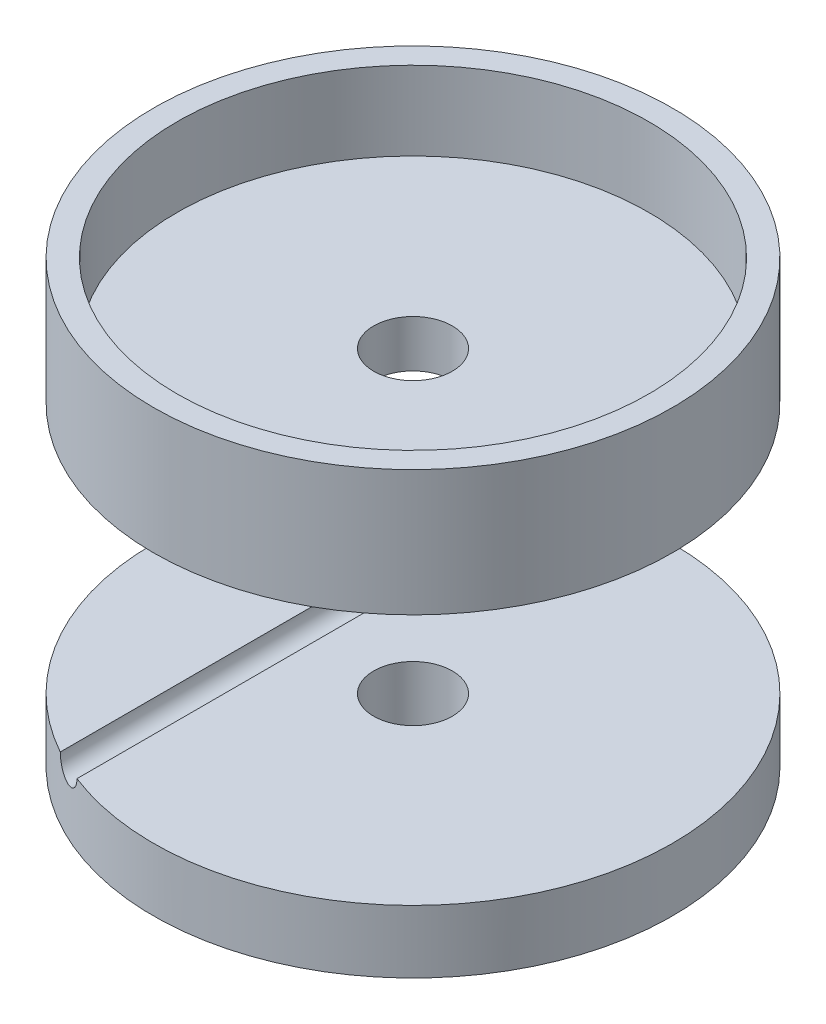
ISO-10303-21;
HEADER;
FILE_DESCRIPTION(('STEP AP214'),'2;1');
FILE_NAME('part.step','',(''),(''),'','','');
FILE_SCHEMA(('AUTOMOTIVE_DESIGN { 1 0 10303 214 1 1 1 1 }'));
ENDSEC;
DATA;
#1=APPLICATION_CONTEXT('core data for automotive mechanical design processes');
#2=APPLICATION_PROTOCOL_DEFINITION('international standard','automotive_design',2000,#1);
#3=PRODUCT_CONTEXT('',#1,'mechanical');
#4=PRODUCT('Part','Part','',(#3));
#5=PRODUCT_RELATED_PRODUCT_CATEGORY('part','',(#4));
#6=PRODUCT_DEFINITION_FORMATION('','',#4);
#7=PRODUCT_DEFINITION_CONTEXT('part definition',#1,'design');
#8=PRODUCT_DEFINITION('design','',#6,#7);
#9=PRODUCT_DEFINITION_SHAPE('','',#8);
#10=(LENGTH_UNIT() NAMED_UNIT(*) SI_UNIT(.MILLI.,.METRE.));
#11=(NAMED_UNIT(*) PLANE_ANGLE_UNIT() SI_UNIT($,.RADIAN.));
#12=(NAMED_UNIT(*) SI_UNIT($,.STERADIAN.) SOLID_ANGLE_UNIT());
#13=UNCERTAINTY_MEASURE_WITH_UNIT(LENGTH_MEASURE(1.E-05),#10,'distance_accuracy_value','');
#14=(GEOMETRIC_REPRESENTATION_CONTEXT(3) GLOBAL_UNCERTAINTY_ASSIGNED_CONTEXT((#13)) GLOBAL_UNIT_ASSIGNED_CONTEXT((#10,
#11,#12)) REPRESENTATION_CONTEXT('',''));
#15=CARTESIAN_POINT('',(0.,0.,0.));
#16=DIRECTION('',(0.,0.,1.));
#17=DIRECTION('',(1.,0.,0.));
#18=AXIS2_PLACEMENT_3D('',#15,#16,#17);
#19=CARTESIAN_POINT('',(0.,-16.,0.));
#20=DIRECTION('',(0.,-1.,0.));
#21=DIRECTION('',(0.,0.,-1.));
#22=AXIS2_PLACEMENT_3D('',#19,#20,#21);
#23=PLANE('',#22);
#24=CARTESIAN_POINT('',(0.,-16.,0.));
#25=DIRECTION('',(0.,-1.,0.));
#26=DIRECTION('',(0.,0.,-1.));
#27=AXIS2_PLACEMENT_3D('',#24,#25,#26);
#28=CIRCLE('',#27,2.5);
#29=CARTESIAN_POINT('',(0.,-16.,-2.5));
#30=VERTEX_POINT('',#29);
#31=EDGE_CURVE('E99',#30,#30,#28,.T.);
#32=ORIENTED_EDGE('',*,*,#31,.T.);
#33=EDGE_LOOP('',(#32));
#34=FACE_BOUND('',#33,.T.);
#35=CARTESIAN_POINT('',(0.,-16.,0.));
#36=DIRECTION('',(0.,-1.,0.));
#37=DIRECTION('',(0.,0.,-1.));
#38=AXIS2_PLACEMENT_3D('',#35,#36,#37);
#39=CIRCLE('',#38,16.5);
#40=CARTESIAN_POINT('',(-6.,-16.,-15.3704261489394));
#41=VERTEX_POINT('',#40);
#42=CARTESIAN_POINT('',(-6.,-16.,15.3704261489394));
#43=VERTEX_POINT('',#42);
#44=EDGE_CURVE('E85',#41,#43,#39,.T.);
#45=ORIENTED_EDGE('',*,*,#44,.F.);
#46=DIRECTION('',(0.,0.,1.));
#47=VECTOR('',#46,1.);
#48=CARTESIAN_POINT('',(-6.,-16.,-16.5));
#49=LINE('',#48,#47);
#50=EDGE_CURVE('E12',#41,#43,#49,.T.);
#51=ORIENTED_EDGE('',*,*,#50,.T.);
#52=EDGE_LOOP('',(#45,#51));
#53=FACE_BOUND('',#52,.T.);
#54=ADVANCED_FACE('F49',(#34,#53),#23,.F.);
#55=CARTESIAN_POINT('',(0.,-16.,0.));
#56=DIRECTION('',(0.,-1.,0.));
#57=DIRECTION('',(0.,0.,-1.));
#58=AXIS2_PLACEMENT_3D('',#55,#56,#57);
#59=CYLINDRICAL_SURFACE('',#58,16.5);
#60=CARTESIAN_POINT('',(-6.,-16.,-15.3704261489394));
#61=CARTESIAN_POINT('',(-5.99999926206739,-16.0266737083966,-15.3704260197381));
#62=CARTESIAN_POINT('',(-6.00106798362648,-16.0533341927296,-15.3700092951358));
#63=CARTESIAN_POINT('',(-6.005325375613,-16.1064549239374,-15.368346524673));
#64=CARTESIAN_POINT('',(-6.00851369494195,-16.132915203241,-15.3671006161616));
#65=CARTESIAN_POINT('',(-6.02120262514664,-16.2115778522633,-15.3621354754465));
#66=CARTESIAN_POINT('',(-6.03382749158354,-16.2632373335658,-15.3571887605155));
#67=CARTESIAN_POINT('',(-6.06691487067275,-16.3635165452906,-15.3441472736558));
#68=CARTESIAN_POINT('',(-6.08737669065643,-16.4121365439158,-15.3360527799424));
#69=CARTESIAN_POINT('',(-6.13537046750988,-16.5051269603056,-15.3169152979954));
#70=CARTESIAN_POINT('',(-6.16290407635965,-16.5494963817998,-15.3058716208044));
#71=CARTESIAN_POINT('',(-6.22484173018992,-16.633989199172,-15.2807881236854));
#72=CARTESIAN_POINT('',(-6.25940021266307,-16.6739788486964,-15.2666803536036));
#73=CARTESIAN_POINT('',(-6.33378246148393,-16.7475924695746,-15.2359711726941));
#74=CARTESIAN_POINT('',(-6.37360790433865,-16.7812144057223,-15.2193689676419));
#75=CARTESIAN_POINT('',(-6.46005581810927,-16.843491972609,-15.1828856125483));
#76=CARTESIAN_POINT('',(-6.5069516151049,-16.871683994198,-15.1628616262036));
#77=CARTESIAN_POINT('',(-6.60397112801003,-16.9198353701643,-15.1208585023697));
#78=CARTESIAN_POINT('',(-6.65409575029276,-16.939792401127,-15.0988788152237));
#79=CARTESIAN_POINT('',(-6.76032464369901,-16.9725659179548,-15.0516326945565));
#80=CARTESIAN_POINT('',(-6.81658792344105,-16.9846908194012,-15.026243837995));
#81=CARTESIAN_POINT('',(-6.92985232213036,-16.9991709331779,-14.9743458325243));
#82=CARTESIAN_POINT('',(-6.98685372197054,-17.0015223096189,-14.9478362478771));
#83=CARTESIAN_POINT('',(-7.10415388867534,-16.996409877711,-14.8924640659281));
#84=CARTESIAN_POINT('',(-7.16440649120026,-16.9882525555459,-14.8635659822647));
#85=CARTESIAN_POINT('',(-7.28258336450953,-16.9611576296323,-14.8060225573794));
#86=CARTESIAN_POINT('',(-7.34050691772942,-16.9422167303729,-14.77737729614));
#87=CARTESIAN_POINT('',(-7.45381590968531,-16.8932814172599,-14.7205550783329));
#88=CARTESIAN_POINT('',(-7.50910442802574,-16.863027621886,-14.6924067783987));
#89=CARTESIAN_POINT('',(-7.61378429042706,-16.7920013588214,-14.6384342734491));
#90=CARTESIAN_POINT('',(-7.66317656955203,-16.7512305622357,-14.6126097000822));
#91=CARTESIAN_POINT('',(-7.7517024208485,-16.6623213074922,-14.5658328969198));
#92=CARTESIAN_POINT('',(-7.791239471844,-16.6146844074105,-14.5446956077332));
#93=CARTESIAN_POINT('',(-7.86143218203278,-16.5116709619649,-14.5068769845929));
#94=CARTESIAN_POINT('',(-7.89209337893741,-16.4562992745057,-14.4901928727777));
#95=CARTESIAN_POINT('',(-7.93972803344417,-16.346499259181,-14.4641408478129));
#96=CARTESIAN_POINT('',(-7.95789276614095,-16.2927363642376,-14.4541403365092));
#97=CARTESIAN_POINT('',(-7.98487103302283,-16.1823098722885,-14.4392547980045));
#98=CARTESIAN_POINT('',(-7.99371219785292,-16.1256553708114,-14.4343546562844));
#99=CARTESIAN_POINT('',(-7.99842685565386,-16.0572442061748,-14.4317416434226));
#100=CARTESIAN_POINT('',(-7.9990169059998,-16.0457983113665,-14.4314146223447));
#101=CARTESIAN_POINT('',(-7.99980277384196,-16.0229031436854,-14.4309790561515));
#102=CARTESIAN_POINT('',(-7.99999908282626,-16.0114538928885,-14.4308702386634));
#103=CARTESIAN_POINT('',(-8.,-16.,-14.4308696896618));
#104=B_SPLINE_CURVE_WITH_KNOTS('',3,(#60,#61,#62,#63,#64,#65,#66,#67,#68,#69,#70,#71,#72,#73,
#74,#75,#76,#77,#78,#79,#80,#81,#82,#83,#84,#85,#86,#87,#88,#89,#90,#91,#92,#93,#94,#95,#96,#97,
#98,#99,#100,#101,#102,#103),.UNSPECIFIED.,.F.,.F.,(4,2,2,2,2,2,2,2,2,2,2,2,2,2,2,2,2,2,2,2,2,
4),(0.,0.0799704324047442,0.159927621493229,0.319322997888253,0.478704289382805,
0.638122846491345,0.801523533545703,0.964976357827887,1.13903166383457,1.31313604416571,
1.50104419203492,1.68902608267779,1.89007272838663,2.09118084788286,2.29721491841289,
2.50321627118658,2.69836046994231,2.89338265307252,3.06529986470395,3.23670615087795,
3.27109930550798,3.30544950206118),.UNSPECIFIED.);
#105=CARTESIAN_POINT('',(-8.,-16.,-14.4308696896618));
#106=VERTEX_POINT('',#105);
#107=EDGE_CURVE('E66',#41,#106,#104,.T.);
#108=ORIENTED_EDGE('',*,*,#107,.F.);
#109=ORIENTED_EDGE('',*,*,#44,.T.);
#110=CARTESIAN_POINT('',(-8.,-16.,14.4308696896618));
#111=CARTESIAN_POINT('',(-8.00000148594661,-16.0257084986515,14.4308684265361));
#112=CARTESIAN_POINT('',(-7.99900787471992,-16.0514035053491,14.4314197341218));
#113=CARTESIAN_POINT('',(-7.99505508353358,-16.1025864897797,14.4336101479054));
#114=CARTESIAN_POINT('',(-7.99209658037501,-16.1280745357408,14.4352488795432));
#115=CARTESIAN_POINT('',(-7.9803498342188,-16.2037259029646,14.4417485342758));
#116=CARTESIAN_POINT('',(-7.96868977119833,-16.2533430579839,14.448193311303));
#117=CARTESIAN_POINT('',(-7.93827209922905,-16.3495635819688,14.4649276558678));
#118=CARTESIAN_POINT('',(-7.91952100316631,-16.3961696706496,14.4752136952212));
#119=CARTESIAN_POINT('',(-7.87569634213005,-16.4854167893375,14.4991044002607));
#120=CARTESIAN_POINT('',(-7.8506174323495,-16.5280544254934,14.5127118710854));
#121=CARTESIAN_POINT('',(-7.7935450363012,-16.6106890272663,14.5434438128985));
#122=CARTESIAN_POINT('',(-7.7612544154346,-16.6504243972718,14.5607170018314));
#123=CARTESIAN_POINT('',(-7.69167416168751,-16.7239840397362,14.5975922494462));
#124=CARTESIAN_POINT('',(-7.65438271543555,-16.7578061576672,14.6171951526214));
#125=CARTESIAN_POINT('',(-7.57109860479741,-16.8227729157471,14.6605223972741));
#126=CARTESIAN_POINT('',(-7.52459850260761,-16.8531252788626,14.6844598575135));
#127=CARTESIAN_POINT('',(-7.42779302201368,-16.9055533121559,14.7336635989156));
#128=CARTESIAN_POINT('',(-7.37748595147523,-16.9276252755572,14.7589304694407));
#129=CARTESIAN_POINT('',(-7.26911062875992,-16.9649765684006,14.8126308646609));
#130=CARTESIAN_POINT('',(-7.21076707604793,-16.9793671157607,14.8411302501516));
#131=CARTESIAN_POINT('',(-7.09240088451056,-16.9975216491735,14.8980591519522));
#132=CARTESIAN_POINT('',(-7.03237769179556,-17.0012820870509,14.9264886417692));
#133=CARTESIAN_POINT('',(-6.90996876269408,-16.9978879905538,14.9835595215204));
#134=CARTESIAN_POINT('',(-6.84757867157137,-16.9903197324247,15.0121690287743));
#135=CARTESIAN_POINT('',(-6.72458506424107,-16.9633834516966,15.067664274096));
#136=CARTESIAN_POINT('',(-6.6639813504263,-16.9440167394046,15.0945502032137));
#137=CARTESIAN_POINT('',(-6.54868311887153,-16.8944901600903,15.1449190742863));
#138=CARTESIAN_POINT('',(-6.49385687423008,-16.8647256604488,15.1684874122354));
#139=CARTESIAN_POINT('',(-6.38989818001122,-16.7947915065548,15.212573393897));
#140=CARTESIAN_POINT('',(-6.34076262882496,-16.754627559326,15.2330927011707));
#141=CARTESIAN_POINT('',(-6.25388875963906,-16.6684044602335,15.2689526371094));
#142=CARTESIAN_POINT('',(-6.21555714712688,-16.6230602405857,15.2845740902699));
#143=CARTESIAN_POINT('',(-6.14714520720001,-16.5255286424195,15.3122164358258));
#144=CARTESIAN_POINT('',(-6.11706307756574,-16.4733427622494,15.324238114697));
#145=CARTESIAN_POINT('',(-6.06859517402999,-16.368195370453,15.3434930887042));
#146=CARTESIAN_POINT('',(-6.04946523481276,-16.3156312033791,15.3510329247328));
#147=CARTESIAN_POINT('',(-6.02022586042272,-16.2077306031792,15.3625236410116));
#148=CARTESIAN_POINT('',(-6.01009809102934,-16.1524000482362,15.36648181613));
#149=CARTESIAN_POINT('',(-6.00311902051767,-16.0805673015387,15.3692082537474));
#150=CARTESIAN_POINT('',(-6.00194901449669,-16.064466315304,15.3696651887444));
#151=CARTESIAN_POINT('',(-6.00039066694123,-16.0322459164747,15.3702736884506));
#152=CARTESIAN_POINT('',(-6.00000111110759,-16.0161265716102,15.3704257275465));
#153=CARTESIAN_POINT('',(-6.,-16.,15.3704261489394));
#154=B_SPLINE_CURVE_WITH_KNOTS('',3,(#110,#111,#112,#113,#114,#115,#116,#117,#118,#119,#120,
#121,#122,#123,#124,#125,#126,#127,#128,#129,#130,#131,#132,#133,#134,#135,#136,#137,#138,#139,
#140,#141,#142,#143,#144,#145,#146,#147,#148,#149,#150,#151,#152,#153),.UNSPECIFIED.,.F.,.F.,(4,
2,2,2,2,2,2,2,2,2,2,2,2,2,2,2,2,2,2,2,2,4),(0.,0.0770741834044095,0.154121832598794,
0.307428292566416,0.460594286118729,0.61389008742965,0.775350559782561,0.936869739152714,
1.11752980647166,1.29827065125702,1.49690458072853,1.69560480348197,1.90174074201079,
2.10785379176823,2.30685675164318,2.50575073300496,2.68895569353402,2.87212059833097,
3.04060615007704,3.20874776513858,3.25718303936743,3.30554289464911),.UNSPECIFIED.);
#155=CARTESIAN_POINT('',(-8.,-16.,14.4308696896618));
#156=VERTEX_POINT('',#155);
#157=EDGE_CURVE('E75',#156,#43,#154,.T.);
#158=ORIENTED_EDGE('',*,*,#157,.F.);
#159=EDGE_CURVE('E80',#156,#106,#39,.T.);
#160=ORIENTED_EDGE('',*,*,#159,.T.);
#161=EDGE_LOOP('',(#108,#109,#158,#160));
#162=FACE_BOUND('',#161,.T.);
#163=CARTESIAN_POINT('',(0.,-20.,0.));
#164=DIRECTION('',(0.,-1.,0.));
#165=DIRECTION('',(0.,0.,-1.));
#166=AXIS2_PLACEMENT_3D('',#163,#164,#165);
#167=CIRCLE('',#166,16.5);
#168=CARTESIAN_POINT('',(0.,-20.,-16.5));
#169=VERTEX_POINT('',#168);
#170=EDGE_CURVE('E92',#169,#169,#167,.T.);
#171=ORIENTED_EDGE('',*,*,#170,.F.);
#172=EDGE_LOOP('',(#171));
#173=FACE_BOUND('',#172,.T.);
#174=ADVANCED_FACE('F51',(#162,#173),#59,.T.);
#175=ORIENTED_EDGE('',*,*,#159,.F.);
#176=DIRECTION('',(0.,0.,1.));
#177=VECTOR('',#176,1.);
#178=CARTESIAN_POINT('',(-8.,-16.,-16.5));
#179=LINE('',#178,#177);
#180=EDGE_CURVE('E59',#156,#106,#179,.F.);
#181=ORIENTED_EDGE('',*,*,#180,.T.);
#182=EDGE_LOOP('',(#175,#181));
#183=FACE_BOUND('',#182,.T.);
#184=ADVANCED_FACE('F88',(#183),#23,.F.);
#185=CARTESIAN_POINT('',(0.,-20.,0.));
#186=DIRECTION('',(0.,-1.,0.));
#187=DIRECTION('',(0.,0.,-1.));
#188=AXIS2_PLACEMENT_3D('',#185,#186,#187);
#189=PLANE('',#188);
#190=CARTESIAN_POINT('',(0.,-20.,0.));
#191=DIRECTION('',(0.,-1.,0.));
#192=DIRECTION('',(0.,0.,-1.));
#193=AXIS2_PLACEMENT_3D('',#190,#191,#192);
#194=CIRCLE('',#193,2.5);
#195=CARTESIAN_POINT('',(0.,-20.,-2.5));
#196=VERTEX_POINT('',#195);
#197=EDGE_CURVE('E95',#196,#196,#194,.T.);
#198=ORIENTED_EDGE('',*,*,#197,.F.);
#199=EDGE_LOOP('',(#198));
#200=FACE_BOUND('',#199,.T.);
#201=ORIENTED_EDGE('',*,*,#170,.T.);
#202=EDGE_LOOP('',(#201));
#203=FACE_BOUND('',#202,.T.);
#204=ADVANCED_FACE('F126',(#200,#203),#189,.T.);
#205=CARTESIAN_POINT('',(0.,-16.,0.));
#206=DIRECTION('',(0.,-1.,0.));
#207=DIRECTION('',(0.,0.,-1.));
#208=AXIS2_PLACEMENT_3D('',#205,#206,#207);
#209=CYLINDRICAL_SURFACE('',#208,2.5);
#210=ORIENTED_EDGE('',*,*,#31,.F.);
#211=EDGE_LOOP('',(#210));
#212=FACE_BOUND('',#211,.T.);
#213=ORIENTED_EDGE('',*,*,#197,.T.);
#214=EDGE_LOOP('',(#213));
#215=FACE_BOUND('',#214,.T.);
#216=ADVANCED_FACE('F122',(#212,#215),#209,.F.);
#217=CARTESIAN_POINT('',(-7.,-16.,-16.5));
#218=DIRECTION('',(0.,0.,1.));
#219=DIRECTION('',(1.,0.,0.));
#220=AXIS2_PLACEMENT_3D('',#217,#218,#219);
#221=CYLINDRICAL_SURFACE('',#220,1.);
#222=ORIENTED_EDGE('',*,*,#107,.T.);
#223=ORIENTED_EDGE('',*,*,#180,.F.);
#224=ORIENTED_EDGE('',*,*,#157,.T.);
#225=ORIENTED_EDGE('',*,*,#50,.F.);
#226=EDGE_LOOP('',(#222,#223,#224,#225));
#227=FACE_BOUND('',#226,.T.);
#228=ADVANCED_FACE('F74',(#227),#221,.F.);
#229=CLOSED_SHELL('',(#54,#174,#184,#204,#216,#228));
#230=MANIFOLD_SOLID_BREP('B2',#229);
#231=CARTESIAN_POINT('',(0.,3.,0.));
#232=DIRECTION('',(0.,-1.,0.));
#233=DIRECTION('',(0.,0.,-1.));
#234=AXIS2_PLACEMENT_3D('',#231,#232,#233);
#235=CYLINDRICAL_SURFACE('',#234,2.5);
#236=CARTESIAN_POINT('',(0.,3.,0.));
#237=DIRECTION('',(0.,1.,0.));
#238=DIRECTION('',(0.,0.,1.));
#239=AXIS2_PLACEMENT_3D('',#236,#237,#238);
#240=CIRCLE('',#239,2.5);
#241=CARTESIAN_POINT('',(0.,3.,2.5));
#242=VERTEX_POINT('',#241);
#243=EDGE_CURVE('E48',#242,#242,#240,.T.);
#244=ORIENTED_EDGE('',*,*,#243,.T.);
#245=EDGE_LOOP('',(#244));
#246=FACE_BOUND('',#245,.T.);
#247=CARTESIAN_POINT('',(0.,0.,0.));
#248=DIRECTION('',(0.,1.,0.));
#249=DIRECTION('',(0.,0.,1.));
#250=AXIS2_PLACEMENT_3D('',#247,#248,#249);
#251=CIRCLE('',#250,2.5);
#252=CARTESIAN_POINT('',(0.,0.,2.5));
#253=VERTEX_POINT('',#252);
#254=EDGE_CURVE('E179',#253,#253,#251,.T.);
#255=ORIENTED_EDGE('',*,*,#254,.F.);
#256=EDGE_LOOP('',(#255));
#257=FACE_BOUND('',#256,.T.);
#258=ADVANCED_FACE('F176',(#246,#257),#235,.F.);
#259=CARTESIAN_POINT('',(0.,3.,0.));
#260=DIRECTION('',(0.,1.,0.));
#261=DIRECTION('',(0.,0.,1.));
#262=AXIS2_PLACEMENT_3D('',#259,#260,#261);
#263=PLANE('',#262);
#264=ORIENTED_EDGE('',*,*,#243,.F.);
#265=EDGE_LOOP('',(#264));
#266=FACE_BOUND('',#265,.T.);
#267=CARTESIAN_POINT('',(0.,3.,0.));
#268=DIRECTION('',(0.,1.,0.));
#269=DIRECTION('',(0.,0.,1.));
#270=AXIS2_PLACEMENT_3D('',#267,#268,#269);
#271=CIRCLE('',#270,15.);
#272=CARTESIAN_POINT('',(0.,3.,15.));
#273=VERTEX_POINT('',#272);
#274=EDGE_CURVE('E186',#273,#273,#271,.F.);
#275=ORIENTED_EDGE('',*,*,#274,.F.);
#276=EDGE_LOOP('',(#275));
#277=FACE_BOUND('',#276,.T.);
#278=ADVANCED_FACE('F216',(#266,#277),#263,.T.);
#279=CARTESIAN_POINT('',(0.,0.,0.));
#280=DIRECTION('',(0.,1.,0.));
#281=DIRECTION('',(0.,0.,1.));
#282=AXIS2_PLACEMENT_3D('',#279,#280,#281);
#283=PLANE('',#282);
#284=ORIENTED_EDGE('',*,*,#254,.T.);
#285=EDGE_LOOP('',(#284));
#286=FACE_BOUND('',#285,.T.);
#287=CARTESIAN_POINT('',(0.,0.,0.));
#288=DIRECTION('',(0.,1.,0.));
#289=DIRECTION('',(0.,0.,1.));
#290=AXIS2_PLACEMENT_3D('',#287,#288,#289);
#291=CIRCLE('',#290,16.5);
#292=CARTESIAN_POINT('',(0.,0.,16.5));
#293=VERTEX_POINT('',#292);
#294=EDGE_CURVE('E191',#293,#293,#291,.T.);
#295=ORIENTED_EDGE('',*,*,#294,.F.);
#296=EDGE_LOOP('',(#295));
#297=FACE_BOUND('',#296,.T.);
#298=ADVANCED_FACE('F214',(#286,#297),#283,.F.);
#299=CARTESIAN_POINT('',(0.,8.,0.));
#300=DIRECTION('',(0.,-1.,0.));
#301=DIRECTION('',(0.,0.,-1.));
#302=AXIS2_PLACEMENT_3D('',#299,#300,#301);
#303=CYLINDRICAL_SURFACE('',#302,15.);
#304=ORIENTED_EDGE('',*,*,#274,.T.);
#305=EDGE_LOOP('',(#304));
#306=FACE_BOUND('',#305,.T.);
#307=CARTESIAN_POINT('',(0.,8.,0.));
#308=DIRECTION('',(0.,1.,0.));
#309=DIRECTION('',(0.,0.,1.));
#310=AXIS2_PLACEMENT_3D('',#307,#308,#309);
#311=CIRCLE('',#310,15.);
#312=CARTESIAN_POINT('',(0.,8.,15.));
#313=VERTEX_POINT('',#312);
#314=EDGE_CURVE('E194',#313,#313,#311,.T.);
#315=ORIENTED_EDGE('',*,*,#314,.T.);
#316=EDGE_LOOP('',(#315));
#317=FACE_BOUND('',#316,.T.);
#318=ADVANCED_FACE('F200',(#306,#317),#303,.F.);
#319=CARTESIAN_POINT('',(0.,8.,0.));
#320=DIRECTION('',(0.,-1.,0.));
#321=DIRECTION('',(0.,0.,-1.));
#322=AXIS2_PLACEMENT_3D('',#319,#320,#321);
#323=CYLINDRICAL_SURFACE('',#322,16.5);
#324=CARTESIAN_POINT('',(0.,8.,0.));
#325=DIRECTION('',(0.,1.,0.));
#326=DIRECTION('',(0.,0.,1.));
#327=AXIS2_PLACEMENT_3D('',#324,#325,#326);
#328=CIRCLE('',#327,16.5);
#329=CARTESIAN_POINT('',(0.,8.,16.5));
#330=VERTEX_POINT('',#329);
#331=EDGE_CURVE('E190',#330,#330,#328,.T.);
#332=ORIENTED_EDGE('',*,*,#331,.F.);
#333=EDGE_LOOP('',(#332));
#334=FACE_BOUND('',#333,.T.);
#335=ORIENTED_EDGE('',*,*,#294,.T.);
#336=EDGE_LOOP('',(#335));
#337=FACE_BOUND('',#336,.T.);
#338=ADVANCED_FACE('F205',(#334,#337),#323,.T.);
#339=CARTESIAN_POINT('',(0.,8.,0.));
#340=DIRECTION('',(0.,1.,0.));
#341=DIRECTION('',(0.,0.,1.));
#342=AXIS2_PLACEMENT_3D('',#339,#340,#341);
#343=PLANE('',#342);
#344=ORIENTED_EDGE('',*,*,#314,.F.);
#345=EDGE_LOOP('',(#344));
#346=FACE_BOUND('',#345,.T.);
#347=ORIENTED_EDGE('',*,*,#331,.T.);
#348=EDGE_LOOP('',(#347));
#349=FACE_BOUND('',#348,.T.);
#350=ADVANCED_FACE('F202',(#346,#349),#343,.T.);
#351=CLOSED_SHELL('',(#258,#278,#298,#318,#338,#350));
#352=MANIFOLD_SOLID_BREP('B6',#351);
#353=ADVANCED_BREP_SHAPE_REPRESENTATION('',(#18,#230,#352),#14);
#354=SHAPE_DEFINITION_REPRESENTATION(#9,#353);
ENDSEC;
END-ISO-10303-21;
